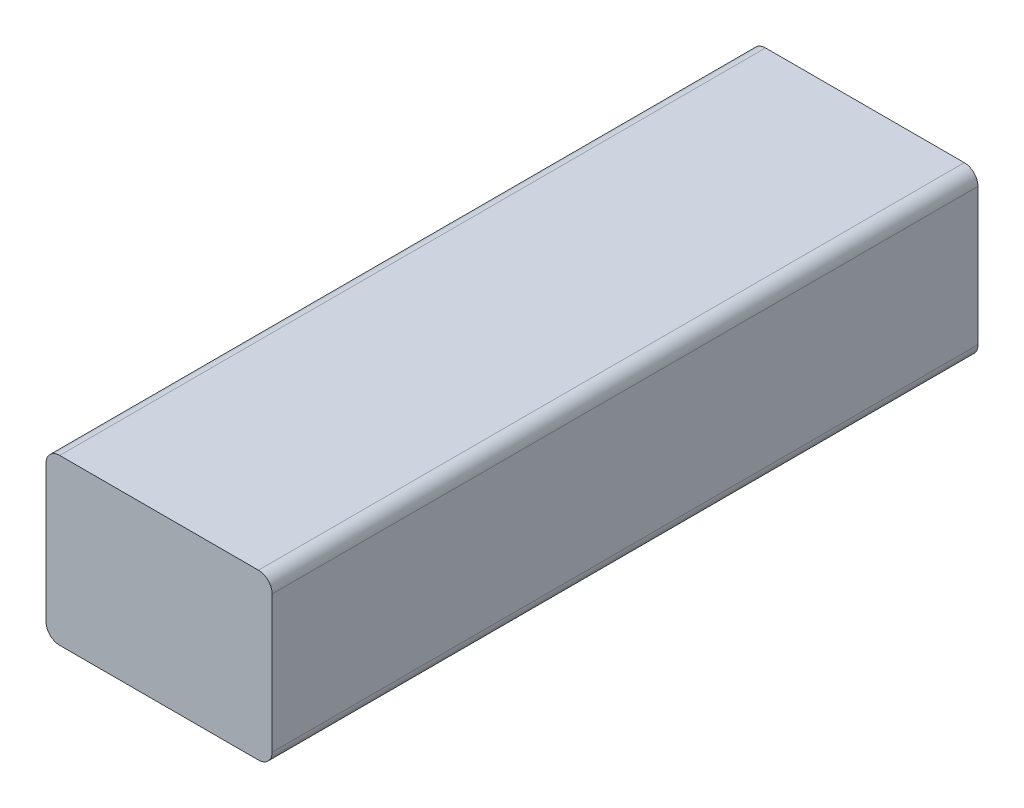
ISO-10303-21;
HEADER;
FILE_DESCRIPTION(('STEP AP214'),'2;1');
FILE_NAME('part.step','',(''),(''),'','','');
FILE_SCHEMA(('AUTOMOTIVE_DESIGN { 1 0 10303 214 1 1 1 1 }'));
ENDSEC;
DATA;
#1=APPLICATION_CONTEXT('core data for automotive mechanical design processes');
#2=APPLICATION_PROTOCOL_DEFINITION('international standard','automotive_design',2000,#1);
#3=PRODUCT_CONTEXT('',#1,'mechanical');
#4=PRODUCT('Part','Part','',(#3));
#5=PRODUCT_RELATED_PRODUCT_CATEGORY('part','',(#4));
#6=PRODUCT_DEFINITION_FORMATION('','',#4);
#7=PRODUCT_DEFINITION_CONTEXT('part definition',#1,'design');
#8=PRODUCT_DEFINITION('design','',#6,#7);
#9=PRODUCT_DEFINITION_SHAPE('','',#8);
#10=(LENGTH_UNIT() NAMED_UNIT(*) SI_UNIT(.MILLI.,.METRE.));
#11=(NAMED_UNIT(*) PLANE_ANGLE_UNIT() SI_UNIT($,.RADIAN.));
#12=(NAMED_UNIT(*) SI_UNIT($,.STERADIAN.) SOLID_ANGLE_UNIT());
#13=UNCERTAINTY_MEASURE_WITH_UNIT(LENGTH_MEASURE(1.E-05),#10,'distance_accuracy_value','');
#14=(GEOMETRIC_REPRESENTATION_CONTEXT(3) GLOBAL_UNCERTAINTY_ASSIGNED_CONTEXT((#13)) GLOBAL_UNIT_ASSIGNED_CONTEXT((#10,
#11,#12)) REPRESENTATION_CONTEXT('',''));
#15=CARTESIAN_POINT('',(0.,0.,0.));
#16=DIRECTION('',(0.,0.,1.));
#17=DIRECTION('',(1.,0.,0.));
#18=AXIS2_PLACEMENT_3D('',#15,#16,#17);
#19=CARTESIAN_POINT('',(16.5,24.,51.5));
#20=DIRECTION('',(-1.,0.,0.));
#21=DIRECTION('',(0.,0.,1.));
#22=AXIS2_PLACEMENT_3D('',#19,#20,#21);
#23=PLANE('',#22);
#24=DIRECTION('',(0.,-1.,0.));
#25=VECTOR('',#24,1.);
#26=CARTESIAN_POINT('',(16.5,24.,51.5));
#27=LINE('',#26,#25);
#28=CARTESIAN_POINT('',(16.5,22.,51.5));
#29=VERTEX_POINT('',#28);
#30=CARTESIAN_POINT('',(16.5,2.,51.5));
#31=VERTEX_POINT('',#30);
#32=EDGE_CURVE('E124',#29,#31,#27,.T.);
#33=ORIENTED_EDGE('',*,*,#32,.T.);
#34=DIRECTION('',(0.,0.,-1.));
#35=VECTOR('',#34,1.);
#36=CARTESIAN_POINT('',(16.5,2.,-51.5));
#37=LINE('',#36,#35);
#38=CARTESIAN_POINT('',(16.5,2.,-51.5));
#39=VERTEX_POINT('',#38);
#40=EDGE_CURVE('E11',#31,#39,#37,.T.);
#41=ORIENTED_EDGE('',*,*,#40,.T.);
#42=DIRECTION('',(0.,-1.,0.));
#43=VECTOR('',#42,1.);
#44=CARTESIAN_POINT('',(16.5,24.,-51.5));
#45=LINE('',#44,#43);
#46=CARTESIAN_POINT('',(16.5,22.,-51.5));
#47=VERTEX_POINT('',#46);
#48=EDGE_CURVE('E129',#47,#39,#45,.T.);
#49=ORIENTED_EDGE('',*,*,#48,.F.);
#50=DIRECTION('',(0.,0.,-1.));
#51=VECTOR('',#50,1.);
#52=CARTESIAN_POINT('',(16.5,22.,51.5));
#53=LINE('',#52,#51);
#54=EDGE_CURVE('E44',#47,#29,#53,.F.);
#55=ORIENTED_EDGE('',*,*,#54,.T.);
#56=EDGE_LOOP('',(#33,#41,#49,#55));
#57=FACE_BOUND('',#56,.T.);
#58=ADVANCED_FACE('F36',(#57),#23,.F.);
#59=CARTESIAN_POINT('',(-16.5,24.,-51.5));
#60=DIRECTION('',(0.,0.,1.));
#61=DIRECTION('',(1.,0.,0.));
#62=AXIS2_PLACEMENT_3D('',#59,#60,#61);
#63=PLANE('',#62);
#64=DIRECTION('',(-1.,0.,0.));
#65=VECTOR('',#64,1.);
#66=CARTESIAN_POINT('',(-16.5,0.,-51.5));
#67=LINE('',#66,#65);
#68=CARTESIAN_POINT('',(14.5,0.,-51.5));
#69=VERTEX_POINT('',#68);
#70=CARTESIAN_POINT('',(-14.5,0.,-51.5));
#71=VERTEX_POINT('',#70);
#72=EDGE_CURVE('E171',#69,#71,#67,.T.);
#73=ORIENTED_EDGE('',*,*,#72,.T.);
#74=CARTESIAN_POINT('',(-14.5,2.,-51.5));
#75=DIRECTION('',(0.,0.,1.));
#76=DIRECTION('',(1.,0.,0.));
#77=AXIS2_PLACEMENT_3D('',#74,#75,#76);
#78=CIRCLE('',#77,2.);
#79=CARTESIAN_POINT('',(-16.5,2.,-51.5));
#80=VERTEX_POINT('',#79);
#81=EDGE_CURVE('E146',#71,#80,#78,.F.);
#82=ORIENTED_EDGE('',*,*,#81,.T.);
#83=DIRECTION('',(0.,-1.,0.));
#84=VECTOR('',#83,1.);
#85=CARTESIAN_POINT('',(-16.5,24.,-51.5));
#86=LINE('',#85,#84);
#87=CARTESIAN_POINT('',(-16.5,22.,-51.5));
#88=VERTEX_POINT('',#87);
#89=EDGE_CURVE('E123',#88,#80,#86,.T.);
#90=ORIENTED_EDGE('',*,*,#89,.F.);
#91=CARTESIAN_POINT('',(-14.5,22.,-51.5));
#92=DIRECTION('',(0.,0.,1.));
#93=DIRECTION('',(1.,0.,0.));
#94=AXIS2_PLACEMENT_3D('',#91,#92,#93);
#95=CIRCLE('',#94,2.);
#96=CARTESIAN_POINT('',(-14.5,24.,-51.5));
#97=VERTEX_POINT('',#96);
#98=EDGE_CURVE('E128',#88,#97,#95,.F.);
#99=ORIENTED_EDGE('',*,*,#98,.T.);
#100=DIRECTION('',(-1.,0.,0.));
#101=VECTOR('',#100,1.);
#102=CARTESIAN_POINT('',(-16.5,24.,-51.5));
#103=LINE('',#102,#101);
#104=CARTESIAN_POINT('',(14.5,24.,-51.5));
#105=VERTEX_POINT('',#104);
#106=EDGE_CURVE('E165',#105,#97,#103,.T.);
#107=ORIENTED_EDGE('',*,*,#106,.F.);
#108=CARTESIAN_POINT('',(14.5,22.,-51.5));
#109=DIRECTION('',(0.,0.,1.));
#110=DIRECTION('',(1.,0.,0.));
#111=AXIS2_PLACEMENT_3D('',#108,#109,#110);
#112=CIRCLE('',#111,2.);
#113=EDGE_CURVE('E58',#105,#47,#112,.F.);
#114=ORIENTED_EDGE('',*,*,#113,.T.);
#115=ORIENTED_EDGE('',*,*,#48,.T.);
#116=CARTESIAN_POINT('',(14.5,2.,-51.5));
#117=DIRECTION('',(0.,0.,1.));
#118=DIRECTION('',(1.,0.,0.));
#119=AXIS2_PLACEMENT_3D('',#116,#117,#118);
#120=CIRCLE('',#119,2.);
#121=EDGE_CURVE('E51',#39,#69,#120,.F.);
#122=ORIENTED_EDGE('',*,*,#121,.T.);
#123=EDGE_LOOP('',(#73,#82,#90,#99,#107,#114,#115,#122));
#124=FACE_BOUND('',#123,.T.);
#125=ADVANCED_FACE('F167',(#124),#63,.F.);
#126=CARTESIAN_POINT('',(-16.5,24.,51.5));
#127=DIRECTION('',(1.,0.,0.));
#128=DIRECTION('',(0.,0.,-1.));
#129=AXIS2_PLACEMENT_3D('',#126,#127,#128);
#130=PLANE('',#129);
#131=ORIENTED_EDGE('',*,*,#89,.T.);
#132=DIRECTION('',(0.,0.,1.));
#133=VECTOR('',#132,1.);
#134=CARTESIAN_POINT('',(-16.5,2.,51.5));
#135=LINE('',#134,#133);
#136=CARTESIAN_POINT('',(-16.5,2.,51.5));
#137=VERTEX_POINT('',#136);
#138=EDGE_CURVE('E122',#80,#137,#135,.T.);
#139=ORIENTED_EDGE('',*,*,#138,.T.);
#140=DIRECTION('',(0.,-1.,0.));
#141=VECTOR('',#140,1.);
#142=CARTESIAN_POINT('',(-16.5,24.,51.5));
#143=LINE('',#142,#141);
#144=CARTESIAN_POINT('',(-16.5,22.,51.5));
#145=VERTEX_POINT('',#144);
#146=EDGE_CURVE('E105',#145,#137,#143,.T.);
#147=ORIENTED_EDGE('',*,*,#146,.F.);
#148=DIRECTION('',(0.,0.,1.));
#149=VECTOR('',#148,1.);
#150=CARTESIAN_POINT('',(-16.5,22.,51.5));
#151=LINE('',#150,#149);
#152=EDGE_CURVE('E119',#145,#88,#151,.F.);
#153=ORIENTED_EDGE('',*,*,#152,.T.);
#154=EDGE_LOOP('',(#131,#139,#147,#153));
#155=FACE_BOUND('',#154,.T.);
#156=ADVANCED_FACE('F118',(#155),#130,.F.);
#157=CARTESIAN_POINT('',(-16.5,24.,51.5));
#158=DIRECTION('',(0.,0.,-1.));
#159=DIRECTION('',(-1.,0.,0.));
#160=AXIS2_PLACEMENT_3D('',#157,#158,#159);
#161=PLANE('',#160);
#162=ORIENTED_EDGE('',*,*,#146,.T.);
#163=CARTESIAN_POINT('',(-14.5,2.,51.5));
#164=DIRECTION('',(0.,0.,-1.));
#165=DIRECTION('',(-1.,0.,0.));
#166=AXIS2_PLACEMENT_3D('',#163,#164,#165);
#167=CIRCLE('',#166,2.);
#168=CARTESIAN_POINT('',(-14.5,0.,51.5));
#169=VERTEX_POINT('',#168);
#170=EDGE_CURVE('E112',#137,#169,#167,.F.);
#171=ORIENTED_EDGE('',*,*,#170,.T.);
#172=DIRECTION('',(1.,0.,0.));
#173=VECTOR('',#172,1.);
#174=CARTESIAN_POINT('',(-16.5,0.,51.5));
#175=LINE('',#174,#173);
#176=CARTESIAN_POINT('',(14.5,0.,51.5));
#177=VERTEX_POINT('',#176);
#178=EDGE_CURVE('E168',#169,#177,#175,.T.);
#179=ORIENTED_EDGE('',*,*,#178,.T.);
#180=CARTESIAN_POINT('',(14.5,2.,51.5));
#181=DIRECTION('',(0.,0.,-1.));
#182=DIRECTION('',(-1.,0.,0.));
#183=AXIS2_PLACEMENT_3D('',#180,#181,#182);
#184=CIRCLE('',#183,2.);
#185=EDGE_CURVE('E113',#177,#31,#184,.F.);
#186=ORIENTED_EDGE('',*,*,#185,.T.);
#187=ORIENTED_EDGE('',*,*,#32,.F.);
#188=CARTESIAN_POINT('',(14.5,22.,51.5));
#189=DIRECTION('',(0.,0.,-1.));
#190=DIRECTION('',(-1.,0.,0.));
#191=AXIS2_PLACEMENT_3D('',#188,#189,#190);
#192=CIRCLE('',#191,2.);
#193=CARTESIAN_POINT('',(14.5,24.,51.5));
#194=VERTEX_POINT('',#193);
#195=EDGE_CURVE('E131',#29,#194,#192,.F.);
#196=ORIENTED_EDGE('',*,*,#195,.T.);
#197=DIRECTION('',(1.,0.,0.));
#198=VECTOR('',#197,1.);
#199=CARTESIAN_POINT('',(-16.5,24.,51.5));
#200=LINE('',#199,#198);
#201=CARTESIAN_POINT('',(-14.5,24.,51.5));
#202=VERTEX_POINT('',#201);
#203=EDGE_CURVE('E107',#202,#194,#200,.T.);
#204=ORIENTED_EDGE('',*,*,#203,.F.);
#205=CARTESIAN_POINT('',(-14.5,22.,51.5));
#206=DIRECTION('',(0.,0.,-1.));
#207=DIRECTION('',(-1.,0.,0.));
#208=AXIS2_PLACEMENT_3D('',#205,#206,#207);
#209=CIRCLE('',#208,2.);
#210=EDGE_CURVE('E102',#202,#145,#209,.F.);
#211=ORIENTED_EDGE('',*,*,#210,.T.);
#212=EDGE_LOOP('',(#162,#171,#179,#186,#187,#196,#204,#211));
#213=FACE_BOUND('',#212,.T.);
#214=ADVANCED_FACE('F104',(#213),#161,.F.);
#215=CARTESIAN_POINT('',(0.,24.,0.));
#216=DIRECTION('',(0.,-1.,0.));
#217=DIRECTION('',(0.,0.,-1.));
#218=AXIS2_PLACEMENT_3D('',#215,#216,#217);
#219=PLANE('',#218);
#220=ORIENTED_EDGE('',*,*,#106,.T.);
#221=DIRECTION('',(0.,0.,1.));
#222=VECTOR('',#221,1.);
#223=CARTESIAN_POINT('',(-14.5,24.,0.));
#224=LINE('',#223,#222);
#225=EDGE_CURVE('E151',#97,#202,#224,.T.);
#226=ORIENTED_EDGE('',*,*,#225,.T.);
#227=ORIENTED_EDGE('',*,*,#203,.T.);
#228=DIRECTION('',(0.,0.,-1.));
#229=VECTOR('',#228,1.);
#230=CARTESIAN_POINT('',(14.5,24.,0.));
#231=LINE('',#230,#229);
#232=EDGE_CURVE('E148',#194,#105,#231,.T.);
#233=ORIENTED_EDGE('',*,*,#232,.T.);
#234=EDGE_LOOP('',(#220,#226,#227,#233));
#235=FACE_BOUND('',#234,.T.);
#236=ADVANCED_FACE('F164',(#235),#219,.F.);
#237=CARTESIAN_POINT('',(0.,0.,0.));
#238=DIRECTION('',(0.,-1.,0.));
#239=DIRECTION('',(0.,0.,-1.));
#240=AXIS2_PLACEMENT_3D('',#237,#238,#239);
#241=PLANE('',#240);
#242=ORIENTED_EDGE('',*,*,#178,.F.);
#243=DIRECTION('',(0.,0.,1.));
#244=VECTOR('',#243,1.);
#245=CARTESIAN_POINT('',(-14.5,0.,-51.5));
#246=LINE('',#245,#244);
#247=EDGE_CURVE('E141',#169,#71,#246,.F.);
#248=ORIENTED_EDGE('',*,*,#247,.T.);
#249=ORIENTED_EDGE('',*,*,#72,.F.);
#250=DIRECTION('',(0.,0.,-1.));
#251=VECTOR('',#250,1.);
#252=CARTESIAN_POINT('',(14.5,0.,51.5));
#253=LINE('',#252,#251);
#254=EDGE_CURVE('E139',#69,#177,#253,.F.);
#255=ORIENTED_EDGE('',*,*,#254,.T.);
#256=EDGE_LOOP('',(#242,#248,#249,#255));
#257=FACE_BOUND('',#256,.T.);
#258=ADVANCED_FACE('F180',(#257),#241,.T.);
#259=CARTESIAN_POINT('',(-14.5,2.,51.5));
#260=DIRECTION('',(0.,0.,-1.));
#261=DIRECTION('',(-1.,0.,0.));
#262=AXIS2_PLACEMENT_3D('',#259,#260,#261);
#263=CYLINDRICAL_SURFACE('',#262,2.);
#264=ORIENTED_EDGE('',*,*,#81,.F.);
#265=ORIENTED_EDGE('',*,*,#247,.F.);
#266=ORIENTED_EDGE('',*,*,#170,.F.);
#267=ORIENTED_EDGE('',*,*,#138,.F.);
#268=EDGE_LOOP('',(#264,#265,#266,#267));
#269=FACE_BOUND('',#268,.T.);
#270=ADVANCED_FACE('F176',(#269),#263,.T.);
#271=CARTESIAN_POINT('',(-14.5,22.,0.));
#272=DIRECTION('',(0.,0.,1.));
#273=DIRECTION('',(1.,0.,0.));
#274=AXIS2_PLACEMENT_3D('',#271,#272,#273);
#275=CYLINDRICAL_SURFACE('',#274,2.);
#276=ORIENTED_EDGE('',*,*,#98,.F.);
#277=ORIENTED_EDGE('',*,*,#152,.F.);
#278=ORIENTED_EDGE('',*,*,#210,.F.);
#279=ORIENTED_EDGE('',*,*,#225,.F.);
#280=EDGE_LOOP('',(#276,#277,#278,#279));
#281=FACE_BOUND('',#280,.T.);
#282=ADVANCED_FACE('F127',(#281),#275,.T.);
#283=CARTESIAN_POINT('',(14.5,2.,51.5));
#284=DIRECTION('',(0.,0.,1.));
#285=DIRECTION('',(1.,0.,0.));
#286=AXIS2_PLACEMENT_3D('',#283,#284,#285);
#287=CYLINDRICAL_SURFACE('',#286,2.);
#288=ORIENTED_EDGE('',*,*,#185,.F.);
#289=ORIENTED_EDGE('',*,*,#254,.F.);
#290=ORIENTED_EDGE('',*,*,#121,.F.);
#291=ORIENTED_EDGE('',*,*,#40,.F.);
#292=EDGE_LOOP('',(#288,#289,#290,#291));
#293=FACE_BOUND('',#292,.T.);
#294=ADVANCED_FACE('F182',(#293),#287,.T.);
#295=CARTESIAN_POINT('',(14.5,22.,0.));
#296=DIRECTION('',(0.,0.,-1.));
#297=DIRECTION('',(-1.,0.,0.));
#298=AXIS2_PLACEMENT_3D('',#295,#296,#297);
#299=CYLINDRICAL_SURFACE('',#298,2.);
#300=ORIENTED_EDGE('',*,*,#195,.F.);
#301=ORIENTED_EDGE('',*,*,#54,.F.);
#302=ORIENTED_EDGE('',*,*,#113,.F.);
#303=ORIENTED_EDGE('',*,*,#232,.F.);
#304=EDGE_LOOP('',(#300,#301,#302,#303));
#305=FACE_BOUND('',#304,.T.);
#306=ADVANCED_FACE('F38',(#305),#299,.T.);
#307=CLOSED_SHELL('',(#58,#125,#156,#214,#236,#258,#270,#282,#294,#306));
#308=MANIFOLD_SOLID_BREP('B2',#307);
#309=ADVANCED_BREP_SHAPE_REPRESENTATION('',(#18,#308),#14);
#310=SHAPE_DEFINITION_REPRESENTATION(#9,#309);
ENDSEC;
END-ISO-10303-21;
